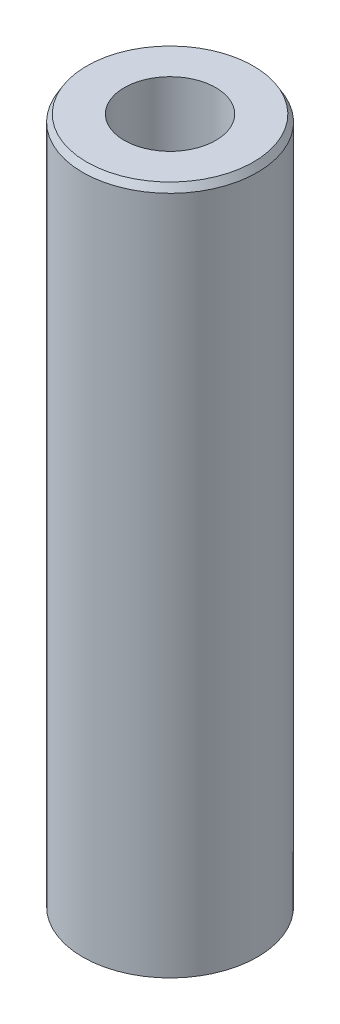
ISO-10303-21;
HEADER;
FILE_DESCRIPTION(('STEP AP214'),'2;1');
FILE_NAME('part.step','',(''),(''),'','','');
FILE_SCHEMA(('AUTOMOTIVE_DESIGN { 1 0 10303 214 1 1 1 1 }'));
ENDSEC;
DATA;
#1=APPLICATION_CONTEXT('core data for automotive mechanical design processes');
#2=APPLICATION_PROTOCOL_DEFINITION('international standard','automotive_design',2000,#1);
#3=PRODUCT_CONTEXT('',#1,'mechanical');
#4=PRODUCT('Part','Part','',(#3));
#5=PRODUCT_RELATED_PRODUCT_CATEGORY('part','',(#4));
#6=PRODUCT_DEFINITION_FORMATION('','',#4);
#7=PRODUCT_DEFINITION_CONTEXT('part definition',#1,'design');
#8=PRODUCT_DEFINITION('design','',#6,#7);
#9=PRODUCT_DEFINITION_SHAPE('','',#8);
#10=(LENGTH_UNIT() NAMED_UNIT(*) SI_UNIT(.MILLI.,.METRE.));
#11=(NAMED_UNIT(*) PLANE_ANGLE_UNIT() SI_UNIT($,.RADIAN.));
#12=(NAMED_UNIT(*) SI_UNIT($,.STERADIAN.) SOLID_ANGLE_UNIT());
#13=UNCERTAINTY_MEASURE_WITH_UNIT(LENGTH_MEASURE(1.E-05),#10,'distance_accuracy_value','');
#14=(GEOMETRIC_REPRESENTATION_CONTEXT(3) GLOBAL_UNCERTAINTY_ASSIGNED_CONTEXT((#13)) GLOBAL_UNIT_ASSIGNED_CONTEXT((#10,
#11,#12)) REPRESENTATION_CONTEXT('',''));
#15=CARTESIAN_POINT('',(0.,0.,0.));
#16=DIRECTION('',(0.,0.,1.));
#17=DIRECTION('',(1.,0.,0.));
#18=AXIS2_PLACEMENT_3D('',#15,#16,#17);
#19=CARTESIAN_POINT('',(0.,256.982664735664,0.));
#20=DIRECTION('',(0.,-1.,0.));
#21=DIRECTION('',(0.,0.,-1.));
#22=AXIS2_PLACEMENT_3D('',#19,#20,#21);
#23=CYLINDRICAL_SURFACE('',#22,32.5);
#24=CARTESIAN_POINT('',(0.,254.392764591605,0.));
#25=DIRECTION('',(0.,1.,0.));
#26=DIRECTION('',(0.,0.,1.));
#27=AXIS2_PLACEMENT_3D('',#24,#25,#26);
#28=CIRCLE('',#27,32.5);
#29=CARTESIAN_POINT('',(0.,254.392764591605,32.5));
#30=VERTEX_POINT('',#29);
#31=EDGE_CURVE('E50',#30,#30,#28,.F.);
#32=ORIENTED_EDGE('',*,*,#31,.T.);
#33=EDGE_LOOP('',(#32));
#34=FACE_BOUND('',#33,.T.);
#35=CARTESIAN_POINT('',(0.,1.49527954534634,0.));
#36=DIRECTION('',(0.,1.,0.));
#37=DIRECTION('',(0.,0.,1.));
#38=AXIS2_PLACEMENT_3D('',#35,#36,#37);
#39=CIRCLE('',#38,32.5);
#40=CARTESIAN_POINT('',(0.,1.49527954534634,32.5));
#41=VERTEX_POINT('',#40);
#42=EDGE_CURVE('E51',#41,#41,#39,.T.);
#43=ORIENTED_EDGE('',*,*,#42,.T.);
#44=EDGE_LOOP('',(#43));
#45=FACE_BOUND('',#44,.T.);
#46=ADVANCED_FACE('F39',(#34,#45),#23,.T.);
#47=CARTESIAN_POINT('',(0.,256.982664735664,0.));
#48=DIRECTION('',(0.,1.,0.));
#49=DIRECTION('',(0.,0.,1.));
#50=AXIS2_PLACEMENT_3D('',#47,#48,#49);
#51=PLANE('',#50);
#52=CARTESIAN_POINT('',(0.,256.982664735664,0.));
#53=DIRECTION('',(0.,1.,0.));
#54=DIRECTION('',(0.,0.,1.));
#55=AXIS2_PLACEMENT_3D('',#52,#53,#54);
#56=CIRCLE('',#55,31.0047204546537);
#57=CARTESIAN_POINT('',(0.,256.982664735664,31.0047204546537));
#58=VERTEX_POINT('',#57);
#59=EDGE_CURVE('E54',#58,#58,#56,.T.);
#60=ORIENTED_EDGE('',*,*,#59,.T.);
#61=EDGE_LOOP('',(#60));
#62=FACE_BOUND('',#61,.T.);
#63=CARTESIAN_POINT('',(0.,256.982664735664,0.));
#64=DIRECTION('',(0.,1.,0.));
#65=DIRECTION('',(0.,0.,1.));
#66=AXIS2_PLACEMENT_3D('',#63,#64,#65);
#67=CIRCLE('',#66,17.0315682177538);
#68=CARTESIAN_POINT('',(0.,256.982664735664,17.0315682177538));
#69=VERTEX_POINT('',#68);
#70=EDGE_CURVE('E58',#69,#69,#67,.T.);
#71=ORIENTED_EDGE('',*,*,#70,.F.);
#72=EDGE_LOOP('',(#71));
#73=FACE_BOUND('',#72,.T.);
#74=ADVANCED_FACE('F69',(#62,#73),#51,.T.);
#75=CARTESIAN_POINT('',(0.,0.,0.));
#76=DIRECTION('',(0.,1.,0.));
#77=DIRECTION('',(0.,0.,1.));
#78=AXIS2_PLACEMENT_3D('',#75,#76,#77);
#79=PLANE('',#78);
#80=CARTESIAN_POINT('',(0.,0.,0.));
#81=DIRECTION('',(0.,1.,0.));
#82=DIRECTION('',(0.,0.,1.));
#83=AXIS2_PLACEMENT_3D('',#80,#81,#82);
#84=CIRCLE('',#83,29.9100998559416);
#85=CARTESIAN_POINT('',(0.,0.,29.9100998559416));
#86=VERTEX_POINT('',#85);
#87=EDGE_CURVE('E10',#86,#86,#84,.F.);
#88=ORIENTED_EDGE('',*,*,#87,.T.);
#89=EDGE_LOOP('',(#88));
#90=FACE_BOUND('',#89,.T.);
#91=CARTESIAN_POINT('',(0.,0.,0.));
#92=DIRECTION('',(0.,1.,0.));
#93=DIRECTION('',(0.,0.,1.));
#94=AXIS2_PLACEMENT_3D('',#91,#92,#93);
#95=CIRCLE('',#94,17.0315682177538);
#96=CARTESIAN_POINT('',(0.,0.,17.0315682177538));
#97=VERTEX_POINT('',#96);
#98=EDGE_CURVE('E63',#97,#97,#95,.T.);
#99=ORIENTED_EDGE('',*,*,#98,.T.);
#100=EDGE_LOOP('',(#99));
#101=FACE_BOUND('',#100,.T.);
#102=ADVANCED_FACE('F75',(#90,#101),#79,.F.);
#103=CARTESIAN_POINT('',(0.,256.982664735664,0.));
#104=DIRECTION('',(0.,-1.,0.));
#105=DIRECTION('',(0.,0.,-1.));
#106=AXIS2_PLACEMENT_3D('',#103,#104,#105);
#107=CYLINDRICAL_SURFACE('',#106,17.0315682177538);
#108=ORIENTED_EDGE('',*,*,#70,.T.);
#109=EDGE_LOOP('',(#108));
#110=FACE_BOUND('',#109,.T.);
#111=ORIENTED_EDGE('',*,*,#98,.F.);
#112=EDGE_LOOP('',(#111));
#113=FACE_BOUND('',#112,.T.);
#114=ADVANCED_FACE('F70',(#110,#113),#107,.F.);
#115=CARTESIAN_POINT('',(0.,256.982664735664,0.));
#116=DIRECTION('',(0.,-1.,0.));
#117=DIRECTION('',(0.,0.,-1.));
#118=AXIS2_PLACEMENT_3D('',#115,#116,#117);
#119=CONICAL_SURFACE('',#118,31.0047204546537,0.523598775598298);
#120=ORIENTED_EDGE('',*,*,#31,.F.);
#121=EDGE_LOOP('',(#120));
#122=FACE_BOUND('',#121,.T.);
#123=ORIENTED_EDGE('',*,*,#59,.F.);
#124=EDGE_LOOP('',(#123));
#125=FACE_BOUND('',#124,.T.);
#126=ADVANCED_FACE('F81',(#122,#125),#119,.T.);
#127=CARTESIAN_POINT('',(0.,1.49527954534634,0.));
#128=DIRECTION('',(0.,1.,0.));
#129=DIRECTION('',(0.,0.,1.));
#130=AXIS2_PLACEMENT_3D('',#127,#128,#129);
#131=CONICAL_SURFACE('',#130,32.5,1.0471975511966);
#132=CARTESIAN_POINT('',(0.,0.,29.9100998559416));
#133=CARTESIAN_POINT('',(0.,0.0155758285973575,29.9370779824423));
#134=CARTESIAN_POINT('',(0.,0.0311516571947152,29.9640561089429));
#135=CARTESIAN_POINT('',(0.,0.0623033143894306,30.0180123619441));
#136=CARTESIAN_POINT('',(0.,0.0778791429867883,30.0449904884447));
#137=CARTESIAN_POINT('',(0.,0.109030800181504,30.0989467414459));
#138=CARTESIAN_POINT('',(0.,0.124606628778861,30.1259248679465));
#139=CARTESIAN_POINT('',(0.,0.155758285973577,30.1798811209477));
#140=CARTESIAN_POINT('',(0.,0.171334114570935,30.2068592474483));
#141=CARTESIAN_POINT('',(0.,0.20248577176565,30.2608155004495));
#142=CARTESIAN_POINT('',(0.,0.218061600363008,30.2877936269502));
#143=CARTESIAN_POINT('',(0.,0.249213257557723,30.3417498799514));
#144=CARTESIAN_POINT('',(0.,0.264789086155081,30.368728006452));
#145=CARTESIAN_POINT('',(0.,0.295940743349796,30.4226842594532));
#146=CARTESIAN_POINT('',(0.,0.311516571947154,30.4496623859538));
#147=CARTESIAN_POINT('',(0.,0.342668229141869,30.503618638955));
#148=CARTESIAN_POINT('',(0.,0.358244057739227,30.5305967654556));
#149=CARTESIAN_POINT('',(0.,0.389395714933942,30.5845530184568));
#150=CARTESIAN_POINT('',(0.,0.4049715435313,30.6115311449574));
#151=CARTESIAN_POINT('',(0.,0.436123200726016,30.6654873979587));
#152=CARTESIAN_POINT('',(0.,0.451699029323373,30.6924655244593));
#153=CARTESIAN_POINT('',(0.,0.482850686518089,30.7464217774605));
#154=CARTESIAN_POINT('',(0.,0.498426515115446,30.7733999039611));
#155=CARTESIAN_POINT('',(0.,0.529578172310162,30.8273561569623));
#156=CARTESIAN_POINT('',(0.,0.54515400090752,30.8543342834629));
#157=CARTESIAN_POINT('',(0.,0.576305658102235,30.9082905364641));
#158=CARTESIAN_POINT('',(0.,0.591881486699593,30.9352686629647));
#159=CARTESIAN_POINT('',(0.,0.623033143894308,30.989224915966));
#160=CARTESIAN_POINT('',(0.,0.638608972491666,31.0162030424666));
#161=CARTESIAN_POINT('',(0.,0.669760629686381,31.0701592954678));
#162=CARTESIAN_POINT('',(0.,0.685336458283739,31.0971374219684));
#163=CARTESIAN_POINT('',(0.,0.716488115478454,31.1510936749696));
#164=CARTESIAN_POINT('',(0.,0.732063944075812,31.1780718014702));
#165=CARTESIAN_POINT('',(0.,0.763215601270527,31.2320280544714));
#166=CARTESIAN_POINT('',(0.,0.778791429867885,31.259006180972));
#167=CARTESIAN_POINT('',(0.,0.809943087062601,31.3129624339733));
#168=CARTESIAN_POINT('',(0.,0.825518915659958,31.3399405604739));
#169=CARTESIAN_POINT('',(0.,0.856670572854674,31.3938968134751));
#170=CARTESIAN_POINT('',(0.,0.872246401452031,31.4208749399757));
#171=CARTESIAN_POINT('',(0.,0.903398058646747,31.4748311929769));
#172=CARTESIAN_POINT('',(0.,0.918973887244104,31.5018093194775));
#173=CARTESIAN_POINT('',(0.,0.95012554443882,31.5557655724787));
#174=CARTESIAN_POINT('',(0.,0.965701373036178,31.5827436989793));
#175=CARTESIAN_POINT('',(0.,0.996853030230893,31.6366999519805));
#176=CARTESIAN_POINT('',(0.,1.01242885882825,31.6636780784812));
#177=CARTESIAN_POINT('',(0.,1.04358051602297,31.7176343314824));
#178=CARTESIAN_POINT('',(0.,1.05915634462032,31.744612457983));
#179=CARTESIAN_POINT('',(0.,1.09030800181504,31.7985687109842));
#180=CARTESIAN_POINT('',(0.,1.1058838304124,31.8255468374848));
#181=CARTESIAN_POINT('',(0.,1.13703548760711,31.879503090486));
#182=CARTESIAN_POINT('',(0.,1.15261131620447,31.9064812169866));
#183=CARTESIAN_POINT('',(0.,1.18376297339919,31.9604374699878));
#184=CARTESIAN_POINT('',(0.,1.19933880199654,31.9874155964885));
#185=CARTESIAN_POINT('',(0.,1.23049045919126,32.0413718494897));
#186=CARTESIAN_POINT('',(0.,1.24606628778862,32.0683499759903));
#187=CARTESIAN_POINT('',(0.,1.27721794498333,32.1223062289915));
#188=CARTESIAN_POINT('',(0.,1.29279377358069,32.1492843554921));
#189=CARTESIAN_POINT('',(0.,1.3239454307754,32.2032406084933));
#190=CARTESIAN_POINT('',(0.,1.33952125937276,32.2302187349939));
#191=CARTESIAN_POINT('',(0.,1.37067291656748,32.2841749879951));
#192=CARTESIAN_POINT('',(0.,1.38624874516484,32.3111531144957));
#193=CARTESIAN_POINT('',(0.,1.41740040235955,32.365109367497));
#194=CARTESIAN_POINT('',(0.,1.43297623095691,32.3920874939976));
#195=CARTESIAN_POINT('',(0.,1.46412788815162,32.4460437469988));
#196=CARTESIAN_POINT('',(0.,1.47970371674898,32.4730218734994));
#197=CARTESIAN_POINT('',(0.,1.49527954534634,32.5));
#198=B_SPLINE_CURVE_WITH_KNOTS('',3,(#132,#133,#134,#135,#136,#137,#138,#139,#140,#141,#142,
#143,#144,#145,#146,#147,#148,#149,#150,#151,#152,#153,#154,#155,#156,#157,#158,#159,#160,#161,
#162,#163,#164,#165,#166,#167,#168,#169,#170,#171,#172,#173,#174,#175,#176,#177,#178,#179,#180,
#181,#182,#183,#184,#185,#186,#187,#188,#189,#190,#191,#192,#193,#194,#195,#196,#197),
.UNSPECIFIED.,.F.,.F.,(4,2,2,2,2,2,2,2,2,2,2,2,2,2,2,2,2,2,2,2,2,2,2,2,2,2,2,2,2,2,2,2,4),(0.,
0.0934549715841463,0.186909943168293,0.280364914752439,0.373819886336585,0.467274857920732,
0.560729829504878,0.654184801089024,0.747639772673171,0.841094744257317,0.934549715841463,
1.02800468742561,1.12145965900976,1.2149146305939,1.30836960217805,1.40182457376219,
1.49527954534634,1.58873451693049,1.68218948851463,1.77564446009878,1.86909943168293,
1.96255440326707,2.05600937485122,2.14946434643536,2.24291931801951,2.33637428960366,
2.4298292611878,2.52328423277195,2.6167392043561,2.71019417594024,2.80364914752439,
2.89710411910853,2.99055909069268),.UNSPECIFIED.);
#199=EDGE_CURVE('BSEAM45',#86,#41,#198,.T.);
#200=ORIENTED_EDGE('',*,*,#87,.F.);
#201=ORIENTED_EDGE('',*,*,#42,.F.);
#202=ORIENTED_EDGE('',*,*,#199,.T.);
#203=ORIENTED_EDGE('',*,*,#199,.F.);
#204=EDGE_LOOP('',(#200,#202,#201,#203));
#205=FACE_BOUND('',#204,.T.);
#206=ADVANCED_FACE('F45',(#205),#131,.T.);
#207=CLOSED_SHELL('',(#46,#74,#102,#114,#126,#206));
#208=MANIFOLD_SOLID_BREP('B2',#207);
#209=ADVANCED_BREP_SHAPE_REPRESENTATION('',(#18,#208),#14);
#210=SHAPE_DEFINITION_REPRESENTATION(#9,#209);
ENDSEC;
END-ISO-10303-21;
